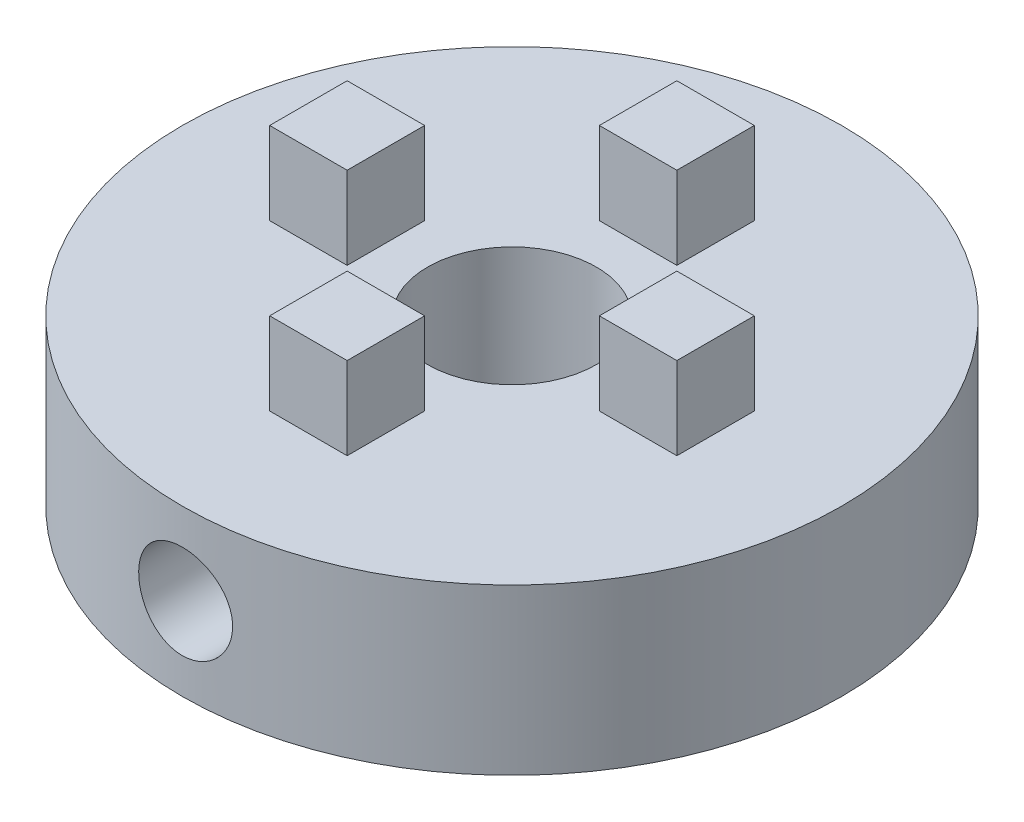
ISO-10303-21;
HEADER;
FILE_DESCRIPTION(('STEP AP214'),'2;1');
FILE_NAME('part.step','',(''),(''),'','','');
FILE_SCHEMA(('AUTOMOTIVE_DESIGN { 1 0 10303 214 1 1 1 1 }'));
ENDSEC;
DATA;
#1=APPLICATION_CONTEXT('core data for automotive mechanical design processes');
#2=APPLICATION_PROTOCOL_DEFINITION('international standard','automotive_design',2000,#1);
#3=PRODUCT_CONTEXT('',#1,'mechanical');
#4=PRODUCT('Part','Part','',(#3));
#5=PRODUCT_RELATED_PRODUCT_CATEGORY('part','',(#4));
#6=PRODUCT_DEFINITION_FORMATION('','',#4);
#7=PRODUCT_DEFINITION_CONTEXT('part definition',#1,'design');
#8=PRODUCT_DEFINITION('design','',#6,#7);
#9=PRODUCT_DEFINITION_SHAPE('','',#8);
#10=(LENGTH_UNIT() NAMED_UNIT(*) SI_UNIT(.MILLI.,.METRE.));
#11=(NAMED_UNIT(*) PLANE_ANGLE_UNIT() SI_UNIT($,.RADIAN.));
#12=(NAMED_UNIT(*) SI_UNIT($,.STERADIAN.) SOLID_ANGLE_UNIT());
#13=UNCERTAINTY_MEASURE_WITH_UNIT(LENGTH_MEASURE(1.E-05),#10,'distance_accuracy_value','');
#14=(GEOMETRIC_REPRESENTATION_CONTEXT(3) GLOBAL_UNCERTAINTY_ASSIGNED_CONTEXT((#13)) GLOBAL_UNIT_ASSIGNED_CONTEXT((#10,
#11,#12)) REPRESENTATION_CONTEXT('',''));
#15=CARTESIAN_POINT('',(0.,0.,0.));
#16=DIRECTION('',(0.,0.,1.));
#17=DIRECTION('',(1.,0.,0.));
#18=AXIS2_PLACEMENT_3D('',#15,#16,#17);
#19=CARTESIAN_POINT('',(0.,10.,0.));
#20=DIRECTION('',(0.,-1.,0.));
#21=DIRECTION('',(0.,0.,-1.));
#22=AXIS2_PLACEMENT_3D('',#19,#20,#21);
#23=CYLINDRICAL_SURFACE('',#22,20.);
#24=CARTESIAN_POINT('',(0.,0.,0.));
#25=DIRECTION('',(0.,1.,0.));
#26=DIRECTION('',(0.,0.,1.));
#27=AXIS2_PLACEMENT_3D('',#24,#25,#26);
#28=CIRCLE('',#27,20.);
#29=CARTESIAN_POINT('',(0.,0.,20.));
#30=VERTEX_POINT('',#29);
#31=EDGE_CURVE('E323',#30,#30,#28,.T.);
#32=ORIENTED_EDGE('',*,*,#31,.T.);
#33=EDGE_LOOP('',(#32));
#34=FACE_BOUND('',#33,.T.);
#35=CARTESIAN_POINT('',(0.,10.,0.));
#36=DIRECTION('',(0.,1.,0.));
#37=DIRECTION('',(0.,0.,1.));
#38=AXIS2_PLACEMENT_3D('',#35,#36,#37);
#39=CIRCLE('',#38,20.);
#40=CARTESIAN_POINT('',(0.,10.,20.));
#41=VERTEX_POINT('',#40);
#42=EDGE_CURVE('E58',#41,#41,#39,.T.);
#43=ORIENTED_EDGE('',*,*,#42,.F.);
#44=EDGE_LOOP('',(#43));
#45=FACE_BOUND('',#44,.T.);
#46=CARTESIAN_POINT('',(0.,2.15,20.));
#47=CARTESIAN_POINT('',(0.159220597601902,2.15000663401519,19.999997539858));
#48=CARTESIAN_POINT('',(0.318535855093513,2.16338776409981,19.9980786844987));
#49=CARTESIAN_POINT('',(0.632719610397276,2.21654879190933,19.9906086304443));
#50=CARTESIAN_POINT('',(0.787583517976093,2.25635498734231,19.9850538133884));
#51=CARTESIAN_POINT('',(1.08827172153135,2.36115793459101,19.9709365650736));
#52=CARTESIAN_POINT('',(1.23410252322149,2.42613630667082,19.9623763286804));
#53=CARTESIAN_POINT('',(1.51276638360188,2.57939563281154,19.9431961042645));
#54=CARTESIAN_POINT('',(1.64560137774481,2.66767310969667,19.9325764236574));
#55=CARTESIAN_POINT('',(1.89546728302553,2.86569127382669,19.9103756970087));
#56=CARTESIAN_POINT('',(2.01239287658,2.97556423386648,19.8987889931623));
#57=CARTESIAN_POINT('',(2.22621272310081,3.21336996106828,19.8760048164301));
#58=CARTESIAN_POINT('',(2.32310586757241,3.34130372696542,19.8648073651122));
#59=CARTESIAN_POINT('',(2.4945150070151,3.61230010913558,19.8440144444241));
#60=CARTESIAN_POINT('',(2.5689300865771,3.75542716512327,19.8344262830255));
#61=CARTESIAN_POINT('',(2.6926259707918,4.05230737296626,19.8180140944292));
#62=CARTESIAN_POINT('',(2.74190801105827,4.2060600020152,19.8111899313486));
#63=CARTESIAN_POINT('',(2.81361392025149,4.51872344376345,19.8011336049838));
#64=CARTESIAN_POINT('',(2.83621737885531,4.67759228348999,19.7978774341475));
#65=CARTESIAN_POINT('',(2.85448064673573,4.9968989120245,19.7952527280753));
#66=CARTESIAN_POINT('',(2.8501418545263,5.15733661896434,19.7958839910511));
#67=CARTESIAN_POINT('',(2.81479075318449,5.47396357498162,19.8009408655297));
#68=CARTESIAN_POINT('',(2.78397775770168,5.63017559502494,19.805338123578));
#69=CARTESIAN_POINT('',(2.69686459579977,5.93518924940246,19.8173872639575));
#70=CARTESIAN_POINT('',(2.64056377301033,6.08399069278768,19.8250392301047));
#71=CARTESIAN_POINT('',(2.50386363333996,6.37056975424894,19.8427671946178));
#72=CARTESIAN_POINT('',(2.42337919748618,6.50830622030809,19.852851729747));
#73=CARTESIAN_POINT('',(2.240657192388,6.76839403365232,19.8743022655916));
#74=CARTESIAN_POINT('',(2.13841833286552,6.89074446769032,19.8856683422978));
#75=CARTESIAN_POINT('',(1.91399224067261,7.11774284816231,19.9085268252002));
#76=CARTESIAN_POINT('',(1.79163350336117,7.22222128627938,19.920019446624));
#77=CARTESIAN_POINT('',(1.53102739782766,7.4091850374753,19.941740732093));
#78=CARTESIAN_POINT('',(1.39277997173841,7.49167027045049,19.9519693915344));
#79=CARTESIAN_POINT('',(1.10417906584821,7.63231212306172,19.970019481073));
#80=CARTESIAN_POINT('',(0.95381951506255,7.69045645063674,19.9778396943888));
#81=CARTESIAN_POINT('',(0.645334234160163,7.7806227195811,19.9901813636095));
#82=CARTESIAN_POINT('',(0.487208978067433,7.81264625328572,19.994703020594));
#83=CARTESIAN_POINT('',(0.169144702322913,7.84943832389168,19.999911639521));
#84=CARTESIAN_POINT('',(0.00923317347973181,7.85444004682281,20.000631408829));
#85=CARTESIAN_POINT('',(-0.309146157725147,7.83766432695207,19.998244227893));
#86=CARTESIAN_POINT('',(-0.467614000182101,7.81588763016082,19.9951373842532));
#87=CARTESIAN_POINT('',(-0.77790712938567,7.74636708980198,19.9854663808907));
#88=CARTESIAN_POINT('',(-0.929758205533332,7.69873608349741,19.978917248428));
#89=CARTESIAN_POINT('',(-1.22331863158352,7.57897744924714,19.9630939695892));
#90=CARTESIAN_POINT('',(-1.36502754568522,7.50684876941963,19.9538197062036));
#91=CARTESIAN_POINT('',(-1.63531156595823,7.3395897490991,19.9334961515912));
#92=CARTESIAN_POINT('',(-1.76379369136366,7.24431055620133,19.9224355354243));
#93=CARTESIAN_POINT('',(-2.00302705768156,7.03366343212809,19.8998077647578));
#94=CARTESIAN_POINT('',(-2.11377737291061,6.91829445282773,19.8882405838533));
#95=CARTESIAN_POINT('',(-2.31524511039574,6.66970794741774,19.8658002275954));
#96=CARTESIAN_POINT('',(-2.40580675907755,6.53636356909708,19.8549328798402));
#97=CARTESIAN_POINT('',(-2.5632458061488,6.25621885656584,19.8352235399862));
#98=CARTESIAN_POINT('',(-2.63012379420634,6.10941885748353,19.826381497464));
#99=CARTESIAN_POINT('',(-2.73805221349558,5.80700662668857,19.8117653593948));
#100=CARTESIAN_POINT('',(-2.77918647710155,5.65142481586857,19.8059813153745));
#101=CARTESIAN_POINT('',(-2.83472769283635,5.33547319963288,19.7981089752667));
#102=CARTESIAN_POINT('',(-2.84913629607712,5.17510369062332,19.7960204508702));
#103=CARTESIAN_POINT('',(-2.85078075598099,4.85568060201485,19.7957835702566));
#104=CARTESIAN_POINT('',(-2.8382614610153,4.69662825470876,19.7975997098805));
#105=CARTESIAN_POINT('',(-2.78692822264851,4.38291478116467,19.8048906293529));
#106=CARTESIAN_POINT('',(-2.74811430563739,4.22825365051968,19.8103654055295));
#107=CARTESIAN_POINT('',(-2.64537707190892,3.92776946050174,19.824344771114));
#108=CARTESIAN_POINT('',(-2.58146919373022,3.78194103054456,19.8328474973397));
#109=CARTESIAN_POINT('',(-2.43038232128556,3.50303698214488,19.8519272207514));
#110=CARTESIAN_POINT('',(-2.34320269509322,3.36996171013792,19.8625042742622));
#111=CARTESIAN_POINT('',(-2.14715120782728,3.11909486602407,19.8846556504724));
#112=CARTESIAN_POINT('',(-2.03809757493737,3.00144602758159,19.896237834646));
#113=CARTESIAN_POINT('',(-1.80177724882134,2.78602962970488,19.9190275961439));
#114=CARTESIAN_POINT('',(-1.674506311338,2.68826671616852,19.9302350854192));
#115=CARTESIAN_POINT('',(-1.40462820691276,2.51497069651331,19.9510754611919));
#116=CARTESIAN_POINT('',(-1.26194830543444,2.4395499222891,19.9607002861389));
#117=CARTESIAN_POINT('',(-0.965880706730123,2.3138532780493,19.9772112527449));
#118=CARTESIAN_POINT('',(-0.812504469061582,2.26355095496615,19.9841002739964));
#119=CARTESIAN_POINT('',(-0.548670962429879,2.20113287737581,19.9927625847196));
#120=CARTESIAN_POINT('',(-0.43985425347647,2.18198678715794,19.9954629075567));
#121=CARTESIAN_POINT('',(-0.220706848975509,2.15641811694065,19.9990824584098));
#122=CARTESIAN_POINT('',(-0.110376169602727,2.1499954011152,20.0000017054392));
#123=CARTESIAN_POINT('',(0.,2.15,20.));
#124=B_SPLINE_CURVE_WITH_KNOTS('',3,(#46,#47,#48,#49,#50,#51,#52,#53,#54,#55,#56,#57,#58,#59,
#60,#61,#62,#63,#64,#65,#66,#67,#68,#69,#70,#71,#72,#73,#74,#75,#76,#77,#78,#79,#80,#81,#82,#83,
#84,#85,#86,#87,#88,#89,#90,#91,#92,#93,#94,#95,#96,#97,#98,#99,#100,#101,#102,#103,#104,#105,
#106,#107,#108,#109,#110,#111,#112,#113,#114,#115,#116,#117,#118,#119,#120,#121,#122,#123),
.UNSPECIFIED.,.T.,.F.,(4,2,2,2,2,2,2,2,2,2,2,2,2,2,2,2,2,2,2,2,2,2,2,2,2,2,2,2,2,2,2,2,2,2,2,2,
2,2,4),(0.,0.477258517787081,0.954992707363484,1.43237872964785,1.90969354673257,
2.39002854327752,2.87039011202972,3.35287726613205,3.83534069746631,4.31453750881385,
4.79370944629932,5.26930518853187,5.74491317914883,6.22221517450057,6.69954548703763,
7.1811783795388,7.6628130262198,8.14469060394401,8.62653880399993,9.10422215011185,
9.5818921889122,10.0574940766366,10.5331163883509,11.0118817628239,11.4906721229448,
11.9730378967639,12.4553916599515,12.9361663902525,13.4169114172896,13.8933036454507,
14.3696953954926,14.84579451347,15.3219065608671,15.8021524769137,16.2825104630464,
16.765244127928,17.2474683322274,17.5783208114913,17.9091697587822),.UNSPECIFIED.);
#125=CARTESIAN_POINT('',(0.,2.15,20.));
#126=VERTEX_POINT('',#125);
#127=EDGE_CURVE('E11',#126,#126,#124,.T.);
#128=ORIENTED_EDGE('',*,*,#127,.F.);
#129=EDGE_LOOP('',(#128));
#130=FACE_BOUND('',#129,.T.);
#131=ADVANCED_FACE('F45',(#34,#45,#130),#23,.T.);
#132=CARTESIAN_POINT('',(0.,5.,20.));
#133=DIRECTION('',(0.,0.,-1.));
#134=DIRECTION('',(-1.,0.,0.));
#135=AXIS2_PLACEMENT_3D('',#132,#133,#134);
#136=CYLINDRICAL_SURFACE('',#135,2.);
#137=CARTESIAN_POINT('',(-2.,5.,4.71864652204422));
#138=CARTESIAN_POINT('',(-2.00000578762234,4.89235917877147,4.71864087723582));
#139=CARTESIAN_POINT('',(-1.99128148782472,4.78475451794615,4.72236954117164));
#140=CARTESIAN_POINT('',(-1.95679113974987,4.57281063835751,4.73676480426923));
#141=CARTESIAN_POINT('',(-1.93102662964805,4.46847112574801,4.74743077721674));
#142=CARTESIAN_POINT('',(-1.86356267643658,4.26618622442936,4.77431234516666));
#143=CARTESIAN_POINT('',(-1.82190429650557,4.16822511376671,4.79051362804143));
#144=CARTESIAN_POINT('',(-1.723982175286,3.98064303408599,4.82661635586645));
#145=CARTESIAN_POINT('',(-1.6677136881104,3.89102478800454,4.84651900255526));
#146=CARTESIAN_POINT('',(-1.53891944186683,3.71783937114475,4.88898373330666));
#147=CARTESIAN_POINT('',(-1.46573157722868,3.63478470529647,4.91162838308456));
#148=CARTESIAN_POINT('',(-1.30657772615958,3.48176230776863,4.95634005649461));
#149=CARTESIAN_POINT('',(-1.2206087226416,3.41179767492385,4.97840694229062));
#150=CARTESIAN_POINT('',(-1.03438620102886,3.28441444073593,5.02046844435902));
#151=CARTESIAN_POINT('',(-0.933719592166502,3.22756089064465,5.04035511729326));
#152=CARTESIAN_POINT('',(-0.723336164989091,3.13181193427674,5.07481498699164));
#153=CARTESIAN_POINT('',(-0.613622785963195,3.09290974023778,5.08939019168776));
#154=CARTESIAN_POINT('',(-0.393653762963542,3.0359892528189,5.11099811073058));
#155=CARTESIAN_POINT('',(-0.283658768116353,3.01708686285201,5.11834900056737));
#156=CARTESIAN_POINT('',(-0.0618286163846342,2.99786125864979,5.12582683151972));
#157=CARTESIAN_POINT('',(0.0500058784267901,2.99753150003937,5.12595631721679));
#158=CARTESIAN_POINT('',(0.265971533418053,3.01496392788337,5.11917382197887));
#159=CARTESIAN_POINT('',(0.370194687588056,3.03175898612674,5.11263824843616));
#160=CARTESIAN_POINT('',(0.574207456311505,3.08132648032702,5.0937619295127));
#161=CARTESIAN_POINT('',(0.673996754023021,3.11410005610638,5.08142076999454));
#162=CARTESIAN_POINT('',(0.868082054613633,3.19510118234817,5.05191507424721));
#163=CARTESIAN_POINT('',(0.962274037944409,3.24355174701785,5.03468140154983));
#164=CARTESIAN_POINT('',(1.14143074145284,3.35432741342946,4.99711436043437));
#165=CARTESIAN_POINT('',(1.22639234734738,3.41665717644591,4.97677995137098));
#166=CARTESIAN_POINT('',(1.39034252007051,3.55799294126375,4.93357956488281));
#167=CARTESIAN_POINT('',(1.46862010699314,3.63780081623542,4.91063480174291));
#168=CARTESIAN_POINT('',(1.61096264895017,3.80952018874052,4.86579962287826));
#169=CARTESIAN_POINT('',(1.67502340046064,3.9014352532672,4.84390952048125));
#170=CARTESIAN_POINT('',(1.78863157922206,4.09778936880921,4.80314169597723));
#171=CARTESIAN_POINT('',(1.83776258163189,4.2024900678166,4.78435611073002));
#172=CARTESIAN_POINT('',(1.91741824722228,4.4196068278868,4.75299765823803));
#173=CARTESIAN_POINT('',(1.94795430300392,4.53201811781526,4.74042098786159));
#174=CARTESIAN_POINT('',(1.98786836712597,4.75429669512242,4.72381702549812));
#175=CARTESIAN_POINT('',(1.99838503769074,4.86392482606045,4.71933045453776));
#176=CARTESIAN_POINT('',(2.00126873525087,5.0834472246546,4.71810933037854));
#177=CARTESIAN_POINT('',(1.99364086374875,5.19334140882871,4.72137259824182));
#178=CARTESIAN_POINT('',(1.96148714895069,5.40414911942988,4.73481401077541));
#179=CARTESIAN_POINT('',(1.93788007993358,5.50522966241944,4.7446157807605));
#180=CARTESIAN_POINT('',(1.87561567091939,5.70193650701864,4.76957100358317));
#181=CARTESIAN_POINT('',(1.8369550939774,5.79756163047955,4.78472560737159));
#182=CARTESIAN_POINT('',(1.74397492050858,5.98484033705981,4.8194111626842));
#183=CARTESIAN_POINT('',(1.68909834059015,6.07618896662555,4.839091025273));
#184=CARTESIAN_POINT('',(1.56582234077128,6.24878229438386,4.88037353578147));
#185=CARTESIAN_POINT('',(1.49741762832862,6.33002301778209,4.90197693441197));
#186=CARTESIAN_POINT('',(1.34339651990036,6.48597213499423,4.94649007624255));
#187=CARTESIAN_POINT('',(1.25691310007093,6.55983128134504,4.9693859901504));
#188=CARTESIAN_POINT('',(1.07222586330931,6.69210839971146,5.01247814881231));
#189=CARTESIAN_POINT('',(0.97402175542571,6.75052598829394,5.03267432652242));
#190=CARTESIAN_POINT('',(0.768508636816092,6.84997229524272,5.06812207301574));
#191=CARTESIAN_POINT('',(0.661214719125564,6.8910291860635,5.08338164325837));
#192=CARTESIAN_POINT('',(0.440505121296026,6.95425538202722,5.10723724983198));
#193=CARTESIAN_POINT('',(0.327092620392373,6.97643439755347,5.11583671177773));
#194=CARTESIAN_POINT('',(0.105009802417273,7.00016448237447,5.12505375209233));
#195=CARTESIAN_POINT('',(-0.00351371138491119,7.00291848731404,5.12613673255765));
#196=CARTESIAN_POINT('',(-0.219417993659444,6.99086436306953,5.12143866148043));
#197=CARTESIAN_POINT('',(-0.326798917874057,6.97605865914555,5.11565855783298));
#198=CARTESIAN_POINT('',(-0.534282974427644,6.93016031939586,5.09810891092108));
#199=CARTESIAN_POINT('',(-0.634505871698667,6.89953770085411,5.08651247976537));
#200=CARTESIAN_POINT('',(-0.828383977648806,6.82335811974725,5.05855791393854));
#201=CARTESIAN_POINT('',(-0.922037940451345,6.77779833341826,5.04219887899707));
#202=CARTESIAN_POINT('',(-1.10458627081271,6.67079771042108,5.00545310767268));
#203=CARTESIAN_POINT('',(-1.19309695839034,6.60875279353292,4.98492223858703));
#204=CARTESIAN_POINT('',(-1.35881099284943,6.47146892170575,4.94232641440077));
#205=CARTESIAN_POINT('',(-1.43601016885699,6.39622512232277,4.92026089783258));
#206=CARTESIAN_POINT('',(-1.58155388493147,6.22948347411915,4.87549463327506));
#207=CARTESIAN_POINT('',(-1.64912137572491,6.13729441713602,4.85283167956852));
#208=CARTESIAN_POINT('',(-1.76787262127908,5.94216513432708,4.81084526291957));
#209=CARTESIAN_POINT('',(-1.81905193922794,5.8392220070117,4.79152270498142));
#210=CARTESIAN_POINT('',(-1.90660158308154,5.61665809272019,4.75740514185469));
#211=CARTESIAN_POINT('',(-1.94146672212637,5.49636200245357,4.7430936598225));
#212=CARTESIAN_POINT('',(-1.98815301182806,5.25069140500734,4.72372146940304));
#213=CARTESIAN_POINT('',(-1.99999326174085,5.12532119504274,4.71865309403174));
#214=CARTESIAN_POINT('',(-2.,5.,4.71864652204422));
#215=B_SPLINE_CURVE_WITH_KNOTS('',3,(#137,#138,#139,#140,#141,#142,#143,#144,#145,#146,#147,
#148,#149,#150,#151,#152,#153,#154,#155,#156,#157,#158,#159,#160,#161,#162,#163,#164,#165,#166,
#167,#168,#169,#170,#171,#172,#173,#174,#175,#176,#177,#178,#179,#180,#181,#182,#183,#184,#185,
#186,#187,#188,#189,#190,#191,#192,#193,#194,#195,#196,#197,#198,#199,#200,#201,#202,#203,#204,
#205,#206,#207,#208,#209,#210,#211,#212,#213,#214),.UNSPECIFIED.,.T.,.F.,(4,2,2,2,2,2,2,2,2,2,2,
2,2,2,2,2,2,2,2,2,2,2,2,2,2,2,2,2,2,2,2,2,2,2,2,2,2,2,4),(0.,0.322454842835148,
0.644880582483201,0.966478887423679,1.28818179001113,1.62566610392035,1.96323021048649,
2.31338057811043,2.66339843825409,2.99719900228042,3.33088194539838,3.64671002362366,
3.96256063464137,4.28311798801008,4.60378316212422,4.94460148097175,5.28552043648415,
5.63522246574122,5.98471002626553,6.31364482123499,6.64248714413618,6.95386823024453,
7.26531630941118,7.589036261571,7.91288311246866,8.25928883577716,8.60570315996352,
8.95155315498894,9.29722514433275,9.62128632722279,9.94530275759767,10.2602017634187,
10.5751603329841,10.9038054644112,11.2325714732676,11.5804756684785,11.9284739732016,
12.3042049329557,12.679624088906),.UNSPECIFIED.);
#216=CARTESIAN_POINT('',(-2.,5.,4.71864652204422));
#217=VERTEX_POINT('',#216);
#218=EDGE_CURVE('E333',#217,#217,#215,.T.);
#219=ORIENTED_EDGE('',*,*,#218,.F.);
#220=EDGE_LOOP('',(#219));
#221=FACE_BOUND('',#220,.T.);
#222=CARTESIAN_POINT('',(0.,5.,10.));
#223=DIRECTION('',(0.,0.,1.));
#224=DIRECTION('',(1.,0.,0.));
#225=AXIS2_PLACEMENT_3D('',#222,#223,#224);
#226=CIRCLE('',#225,2.);
#227=CARTESIAN_POINT('',(2.,5.,10.));
#228=VERTEX_POINT('',#227);
#229=EDGE_CURVE('E341',#228,#228,#226,.T.);
#230=ORIENTED_EDGE('',*,*,#229,.T.);
#231=EDGE_LOOP('',(#230));
#232=FACE_BOUND('',#231,.T.);
#233=ADVANCED_FACE('F346',(#221,#232),#136,.F.);
#234=CARTESIAN_POINT('',(0.,10.,0.));
#235=DIRECTION('',(0.,-1.,0.));
#236=DIRECTION('',(0.,0.,-1.));
#237=AXIS2_PLACEMENT_3D('',#234,#235,#236);
#238=CYLINDRICAL_SURFACE('',#237,5.125);
#239=CARTESIAN_POINT('',(0.,0.,0.));
#240=DIRECTION('',(0.,1.,0.));
#241=DIRECTION('',(0.,0.,1.));
#242=AXIS2_PLACEMENT_3D('',#239,#240,#241);
#243=CIRCLE('',#242,5.125);
#244=CARTESIAN_POINT('',(0.,0.,5.125));
#245=VERTEX_POINT('',#244);
#246=EDGE_CURVE('E318',#245,#245,#243,.T.);
#247=ORIENTED_EDGE('',*,*,#246,.F.);
#248=EDGE_LOOP('',(#247));
#249=FACE_BOUND('',#248,.T.);
#250=CARTESIAN_POINT('',(0.,10.,0.));
#251=DIRECTION('',(0.,1.,0.));
#252=DIRECTION('',(0.,0.,1.));
#253=AXIS2_PLACEMENT_3D('',#250,#251,#252);
#254=CIRCLE('',#253,5.125);
#255=CARTESIAN_POINT('',(0.,10.,5.125));
#256=VERTEX_POINT('',#255);
#257=EDGE_CURVE('E319',#256,#256,#254,.T.);
#258=ORIENTED_EDGE('',*,*,#257,.T.);
#259=EDGE_LOOP('',(#258));
#260=FACE_BOUND('',#259,.T.);
#261=ORIENTED_EDGE('',*,*,#218,.T.);
#262=EDGE_LOOP('',(#261));
#263=FACE_BOUND('',#262,.T.);
#264=ADVANCED_FACE('F342',(#249,#260,#263),#238,.F.);
#265=CARTESIAN_POINT('',(0.,10.,0.));
#266=DIRECTION('',(0.,1.,0.));
#267=DIRECTION('',(0.,0.,1.));
#268=AXIS2_PLACEMENT_3D('',#265,#266,#267);
#269=PLANE('',#268);
#270=ORIENTED_EDGE('',*,*,#42,.T.);
#271=EDGE_LOOP('',(#270));
#272=FACE_BOUND('',#271,.T.);
#273=ORIENTED_EDGE('',*,*,#257,.F.);
#274=EDGE_LOOP('',(#273));
#275=FACE_BOUND('',#274,.T.);
#276=DIRECTION('',(-1.,0.,0.));
#277=VECTOR('',#276,1.);
#278=CARTESIAN_POINT('',(-2.35,10.,-12.35));
#279=LINE('',#278,#277);
#280=CARTESIAN_POINT('',(2.35,10.,-12.35));
#281=VERTEX_POINT('',#280);
#282=CARTESIAN_POINT('',(-2.35,10.,-12.35));
#283=VERTEX_POINT('',#282);
#284=EDGE_CURVE('E296',#281,#283,#279,.T.);
#285=ORIENTED_EDGE('',*,*,#284,.F.);
#286=DIRECTION('',(0.,0.,-1.));
#287=VECTOR('',#286,1.);
#288=CARTESIAN_POINT('',(2.35,10.,-7.65));
#289=LINE('',#288,#287);
#290=CARTESIAN_POINT('',(2.35,10.,-7.65));
#291=VERTEX_POINT('',#290);
#292=EDGE_CURVE('E277',#291,#281,#289,.T.);
#293=ORIENTED_EDGE('',*,*,#292,.F.);
#294=DIRECTION('',(1.,0.,0.));
#295=VECTOR('',#294,1.);
#296=CARTESIAN_POINT('',(-2.35,10.,-7.65));
#297=LINE('',#296,#295);
#298=CARTESIAN_POINT('',(-2.35,10.,-7.65));
#299=VERTEX_POINT('',#298);
#300=EDGE_CURVE('E283',#299,#291,#297,.T.);
#301=ORIENTED_EDGE('',*,*,#300,.F.);
#302=DIRECTION('',(0.,0.,1.));
#303=VECTOR('',#302,1.);
#304=CARTESIAN_POINT('',(-2.35,10.,-7.65));
#305=LINE('',#304,#303);
#306=EDGE_CURVE('E299',#283,#299,#305,.T.);
#307=ORIENTED_EDGE('',*,*,#306,.F.);
#308=EDGE_LOOP('',(#285,#293,#301,#307));
#309=FACE_BOUND('',#308,.T.);
#310=DIRECTION('',(-1.,0.,0.));
#311=VECTOR('',#310,1.);
#312=CARTESIAN_POINT('',(7.65,10.,-2.35));
#313=LINE('',#312,#311);
#314=CARTESIAN_POINT('',(12.35,10.,-2.35));
#315=VERTEX_POINT('',#314);
#316=CARTESIAN_POINT('',(7.65,10.,-2.35));
#317=VERTEX_POINT('',#316);
#318=EDGE_CURVE('E255',#315,#317,#313,.T.);
#319=ORIENTED_EDGE('',*,*,#318,.F.);
#320=DIRECTION('',(0.,0.,-1.));
#321=VECTOR('',#320,1.);
#322=CARTESIAN_POINT('',(12.35,10.,-2.35));
#323=LINE('',#322,#321);
#324=CARTESIAN_POINT('',(12.35,10.,2.35));
#325=VERTEX_POINT('',#324);
#326=EDGE_CURVE('E236',#325,#315,#323,.T.);
#327=ORIENTED_EDGE('',*,*,#326,.F.);
#328=DIRECTION('',(1.,0.,0.));
#329=VECTOR('',#328,1.);
#330=CARTESIAN_POINT('',(7.65,10.,2.35));
#331=LINE('',#330,#329);
#332=CARTESIAN_POINT('',(7.65,10.,2.35));
#333=VERTEX_POINT('',#332);
#334=EDGE_CURVE('E242',#333,#325,#331,.T.);
#335=ORIENTED_EDGE('',*,*,#334,.F.);
#336=DIRECTION('',(0.,0.,1.));
#337=VECTOR('',#336,1.);
#338=CARTESIAN_POINT('',(7.65,10.,-2.35));
#339=LINE('',#338,#337);
#340=EDGE_CURVE('E258',#317,#333,#339,.T.);
#341=ORIENTED_EDGE('',*,*,#340,.F.);
#342=EDGE_LOOP('',(#319,#327,#335,#341));
#343=FACE_BOUND('',#342,.T.);
#344=DIRECTION('',(0.,0.,-1.));
#345=VECTOR('',#344,1.);
#346=CARTESIAN_POINT('',(2.35,10.,7.65));
#347=LINE('',#346,#345);
#348=CARTESIAN_POINT('',(2.35,10.,12.35));
#349=VERTEX_POINT('',#348);
#350=CARTESIAN_POINT('',(2.35,10.,7.65));
#351=VERTEX_POINT('',#350);
#352=EDGE_CURVE('E197',#349,#351,#347,.T.);
#353=ORIENTED_EDGE('',*,*,#352,.F.);
#354=DIRECTION('',(1.,0.,0.));
#355=VECTOR('',#354,1.);
#356=CARTESIAN_POINT('',(2.35,10.,12.35));
#357=LINE('',#356,#355);
#358=CARTESIAN_POINT('',(-2.35,10.,12.35));
#359=VERTEX_POINT('',#358);
#360=EDGE_CURVE('E192',#359,#349,#357,.T.);
#361=ORIENTED_EDGE('',*,*,#360,.F.);
#362=DIRECTION('',(0.,0.,1.));
#363=VECTOR('',#362,1.);
#364=CARTESIAN_POINT('',(-2.35,10.,7.65));
#365=LINE('',#364,#363);
#366=CARTESIAN_POINT('',(-2.35,10.,7.65));
#367=VERTEX_POINT('',#366);
#368=EDGE_CURVE('E207',#367,#359,#365,.T.);
#369=ORIENTED_EDGE('',*,*,#368,.F.);
#370=DIRECTION('',(-1.,0.,0.));
#371=VECTOR('',#370,1.);
#372=CARTESIAN_POINT('',(2.35,10.,7.65));
#373=LINE('',#372,#371);
#374=EDGE_CURVE('E219',#351,#367,#373,.T.);
#375=ORIENTED_EDGE('',*,*,#374,.F.);
#376=EDGE_LOOP('',(#353,#361,#369,#375));
#377=FACE_BOUND('',#376,.T.);
#378=DIRECTION('',(1.,0.,0.));
#379=VECTOR('',#378,1.);
#380=CARTESIAN_POINT('',(-7.65,10.,2.35));
#381=LINE('',#380,#379);
#382=CARTESIAN_POINT('',(-12.35,10.,2.35));
#383=VERTEX_POINT('',#382);
#384=CARTESIAN_POINT('',(-7.65,10.,2.35));
#385=VERTEX_POINT('',#384);
#386=EDGE_CURVE('E463',#383,#385,#381,.T.);
#387=ORIENTED_EDGE('',*,*,#386,.F.);
#388=DIRECTION('',(0.,0.,1.));
#389=VECTOR('',#388,1.);
#390=CARTESIAN_POINT('',(-12.35,10.,2.35));
#391=LINE('',#390,#389);
#392=CARTESIAN_POINT('',(-12.35,10.,-2.35));
#393=VERTEX_POINT('',#392);
#394=EDGE_CURVE('E189',#393,#383,#391,.T.);
#395=ORIENTED_EDGE('',*,*,#394,.F.);
#396=DIRECTION('',(-1.,0.,0.));
#397=VECTOR('',#396,1.);
#398=CARTESIAN_POINT('',(-7.65,10.,-2.35));
#399=LINE('',#398,#397);
#400=CARTESIAN_POINT('',(-7.65,10.,-2.35));
#401=VERTEX_POINT('',#400);
#402=EDGE_CURVE('E185',#401,#393,#399,.T.);
#403=ORIENTED_EDGE('',*,*,#402,.F.);
#404=DIRECTION('',(0.,0.,-1.));
#405=VECTOR('',#404,1.);
#406=CARTESIAN_POINT('',(-7.65,10.,2.35));
#407=LINE('',#406,#405);
#408=EDGE_CURVE('E466',#385,#401,#407,.T.);
#409=ORIENTED_EDGE('',*,*,#408,.F.);
#410=EDGE_LOOP('',(#387,#395,#403,#409));
#411=FACE_BOUND('',#410,.T.);
#412=ADVANCED_FACE('F428',(#272,#275,#309,#343,#377,#411),#269,.T.);
#413=CARTESIAN_POINT('',(0.,0.,0.));
#414=DIRECTION('',(0.,1.,0.));
#415=DIRECTION('',(0.,0.,1.));
#416=AXIS2_PLACEMENT_3D('',#413,#414,#415);
#417=PLANE('',#416);
#418=ORIENTED_EDGE('',*,*,#31,.F.);
#419=EDGE_LOOP('',(#418));
#420=FACE_BOUND('',#419,.T.);
#421=ORIENTED_EDGE('',*,*,#246,.T.);
#422=EDGE_LOOP('',(#421));
#423=FACE_BOUND('',#422,.T.);
#424=ADVANCED_FACE('F423',(#420,#423),#417,.F.);
#425=CARTESIAN_POINT('',(2.35,15.,-7.65));
#426=DIRECTION('',(-1.,0.,0.));
#427=DIRECTION('',(0.,0.,1.));
#428=AXIS2_PLACEMENT_3D('',#425,#426,#427);
#429=PLANE('',#428);
#430=ORIENTED_EDGE('',*,*,#292,.T.);
#431=DIRECTION('',(0.,-1.,0.));
#432=VECTOR('',#431,1.);
#433=CARTESIAN_POINT('',(2.35,15.,-12.35));
#434=LINE('',#433,#432);
#435=CARTESIAN_POINT('',(2.35,15.,-12.35));
#436=VERTEX_POINT('',#435);
#437=EDGE_CURVE('E315',#436,#281,#434,.T.);
#438=ORIENTED_EDGE('',*,*,#437,.F.);
#439=DIRECTION('',(0.,0.,-1.));
#440=VECTOR('',#439,1.);
#441=CARTESIAN_POINT('',(2.35,15.,-7.65));
#442=LINE('',#441,#440);
#443=CARTESIAN_POINT('',(2.35,15.,-7.65));
#444=VERTEX_POINT('',#443);
#445=EDGE_CURVE('E278',#444,#436,#442,.T.);
#446=ORIENTED_EDGE('',*,*,#445,.F.);
#447=DIRECTION('',(0.,-1.,0.));
#448=VECTOR('',#447,1.);
#449=CARTESIAN_POINT('',(2.35,15.,-7.65));
#450=LINE('',#449,#448);
#451=EDGE_CURVE('E292',#444,#291,#450,.T.);
#452=ORIENTED_EDGE('',*,*,#451,.T.);
#453=EDGE_LOOP('',(#430,#438,#446,#452));
#454=FACE_BOUND('',#453,.T.);
#455=ADVANCED_FACE('F420',(#454),#429,.F.);
#456=CARTESIAN_POINT('',(-2.35,15.,-12.35));
#457=DIRECTION('',(0.,0.,1.));
#458=DIRECTION('',(1.,0.,0.));
#459=AXIS2_PLACEMENT_3D('',#456,#457,#458);
#460=PLANE('',#459);
#461=ORIENTED_EDGE('',*,*,#284,.T.);
#462=DIRECTION('',(0.,-1.,0.));
#463=VECTOR('',#462,1.);
#464=CARTESIAN_POINT('',(-2.35,15.,-12.35));
#465=LINE('',#464,#463);
#466=CARTESIAN_POINT('',(-2.35,15.,-12.35));
#467=VERTEX_POINT('',#466);
#468=EDGE_CURVE('E311',#467,#283,#465,.T.);
#469=ORIENTED_EDGE('',*,*,#468,.F.);
#470=DIRECTION('',(-1.,0.,0.));
#471=VECTOR('',#470,1.);
#472=CARTESIAN_POINT('',(-2.35,15.,-12.35));
#473=LINE('',#472,#471);
#474=EDGE_CURVE('E282',#436,#467,#473,.T.);
#475=ORIENTED_EDGE('',*,*,#474,.F.);
#476=ORIENTED_EDGE('',*,*,#437,.T.);
#477=EDGE_LOOP('',(#461,#469,#475,#476));
#478=FACE_BOUND('',#477,.T.);
#479=ADVANCED_FACE('F417',(#478),#460,.F.);
#480=CARTESIAN_POINT('',(-2.35,15.,-7.65));
#481=DIRECTION('',(1.,0.,0.));
#482=DIRECTION('',(0.,0.,-1.));
#483=AXIS2_PLACEMENT_3D('',#480,#481,#482);
#484=PLANE('',#483);
#485=ORIENTED_EDGE('',*,*,#306,.T.);
#486=DIRECTION('',(0.,-1.,0.));
#487=VECTOR('',#486,1.);
#488=CARTESIAN_POINT('',(-2.35,15.,-7.65));
#489=LINE('',#488,#487);
#490=CARTESIAN_POINT('',(-2.35,15.,-7.65));
#491=VERTEX_POINT('',#490);
#492=EDGE_CURVE('E308',#491,#299,#489,.T.);
#493=ORIENTED_EDGE('',*,*,#492,.F.);
#494=DIRECTION('',(0.,0.,1.));
#495=VECTOR('',#494,1.);
#496=CARTESIAN_POINT('',(-2.35,15.,-7.65));
#497=LINE('',#496,#495);
#498=EDGE_CURVE('E286',#467,#491,#497,.T.);
#499=ORIENTED_EDGE('',*,*,#498,.F.);
#500=ORIENTED_EDGE('',*,*,#468,.T.);
#501=EDGE_LOOP('',(#485,#493,#499,#500));
#502=FACE_BOUND('',#501,.T.);
#503=ADVANCED_FACE('F413',(#502),#484,.F.);
#504=CARTESIAN_POINT('',(-2.35,15.,-7.65));
#505=DIRECTION('',(0.,0.,-1.));
#506=DIRECTION('',(-1.,0.,0.));
#507=AXIS2_PLACEMENT_3D('',#504,#505,#506);
#508=PLANE('',#507);
#509=ORIENTED_EDGE('',*,*,#300,.T.);
#510=ORIENTED_EDGE('',*,*,#451,.F.);
#511=DIRECTION('',(1.,0.,0.));
#512=VECTOR('',#511,1.);
#513=CARTESIAN_POINT('',(-2.35,15.,-7.65));
#514=LINE('',#513,#512);
#515=EDGE_CURVE('E289',#491,#444,#514,.T.);
#516=ORIENTED_EDGE('',*,*,#515,.F.);
#517=ORIENTED_EDGE('',*,*,#492,.T.);
#518=EDGE_LOOP('',(#509,#510,#516,#517));
#519=FACE_BOUND('',#518,.T.);
#520=ADVANCED_FACE('F409',(#519),#508,.F.);
#521=CARTESIAN_POINT('',(0.,15.,0.));
#522=DIRECTION('',(0.,-1.,0.));
#523=DIRECTION('',(0.,0.,-1.));
#524=AXIS2_PLACEMENT_3D('',#521,#522,#523);
#525=PLANE('',#524);
#526=ORIENTED_EDGE('',*,*,#445,.T.);
#527=ORIENTED_EDGE('',*,*,#474,.T.);
#528=ORIENTED_EDGE('',*,*,#498,.T.);
#529=ORIENTED_EDGE('',*,*,#515,.T.);
#530=EDGE_LOOP('',(#526,#527,#528,#529));
#531=FACE_BOUND('',#530,.T.);
#532=ADVANCED_FACE('F405',(#531),#525,.F.);
#533=CARTESIAN_POINT('',(12.35,15.,-2.35));
#534=DIRECTION('',(-1.,0.,0.));
#535=DIRECTION('',(0.,0.,1.));
#536=AXIS2_PLACEMENT_3D('',#533,#534,#535);
#537=PLANE('',#536);
#538=ORIENTED_EDGE('',*,*,#326,.T.);
#539=DIRECTION('',(0.,-1.,0.));
#540=VECTOR('',#539,1.);
#541=CARTESIAN_POINT('',(12.35,15.,-2.35));
#542=LINE('',#541,#540);
#543=CARTESIAN_POINT('',(12.35,15.,-2.35));
#544=VERTEX_POINT('',#543);
#545=EDGE_CURVE('E274',#544,#315,#542,.T.);
#546=ORIENTED_EDGE('',*,*,#545,.F.);
#547=DIRECTION('',(0.,0.,-1.));
#548=VECTOR('',#547,1.);
#549=CARTESIAN_POINT('',(12.35,15.,-2.35));
#550=LINE('',#549,#548);
#551=CARTESIAN_POINT('',(12.35,15.,2.35));
#552=VERTEX_POINT('',#551);
#553=EDGE_CURVE('E237',#552,#544,#550,.T.);
#554=ORIENTED_EDGE('',*,*,#553,.F.);
#555=DIRECTION('',(0.,-1.,0.));
#556=VECTOR('',#555,1.);
#557=CARTESIAN_POINT('',(12.35,15.,2.35));
#558=LINE('',#557,#556);
#559=EDGE_CURVE('E251',#552,#325,#558,.T.);
#560=ORIENTED_EDGE('',*,*,#559,.T.);
#561=EDGE_LOOP('',(#538,#546,#554,#560));
#562=FACE_BOUND('',#561,.T.);
#563=ADVANCED_FACE('F401',(#562),#537,.F.);
#564=CARTESIAN_POINT('',(7.65,15.,-2.35));
#565=DIRECTION('',(0.,0.,1.));
#566=DIRECTION('',(1.,0.,0.));
#567=AXIS2_PLACEMENT_3D('',#564,#565,#566);
#568=PLANE('',#567);
#569=ORIENTED_EDGE('',*,*,#318,.T.);
#570=DIRECTION('',(0.,-1.,0.));
#571=VECTOR('',#570,1.);
#572=CARTESIAN_POINT('',(7.65,15.,-2.35));
#573=LINE('',#572,#571);
#574=CARTESIAN_POINT('',(7.65,15.,-2.35));
#575=VERTEX_POINT('',#574);
#576=EDGE_CURVE('E270',#575,#317,#573,.T.);
#577=ORIENTED_EDGE('',*,*,#576,.F.);
#578=DIRECTION('',(-1.,0.,0.));
#579=VECTOR('',#578,1.);
#580=CARTESIAN_POINT('',(7.65,15.,-2.35));
#581=LINE('',#580,#579);
#582=EDGE_CURVE('E241',#544,#575,#581,.T.);
#583=ORIENTED_EDGE('',*,*,#582,.F.);
#584=ORIENTED_EDGE('',*,*,#545,.T.);
#585=EDGE_LOOP('',(#569,#577,#583,#584));
#586=FACE_BOUND('',#585,.T.);
#587=ADVANCED_FACE('F397',(#586),#568,.F.);
#588=CARTESIAN_POINT('',(7.65,15.,-2.35));
#589=DIRECTION('',(1.,0.,0.));
#590=DIRECTION('',(0.,0.,-1.));
#591=AXIS2_PLACEMENT_3D('',#588,#589,#590);
#592=PLANE('',#591);
#593=ORIENTED_EDGE('',*,*,#340,.T.);
#594=DIRECTION('',(0.,-1.,0.));
#595=VECTOR('',#594,1.);
#596=CARTESIAN_POINT('',(7.65,15.,2.35));
#597=LINE('',#596,#595);
#598=CARTESIAN_POINT('',(7.65,15.,2.35));
#599=VERTEX_POINT('',#598);
#600=EDGE_CURVE('E267',#599,#333,#597,.T.);
#601=ORIENTED_EDGE('',*,*,#600,.F.);
#602=DIRECTION('',(0.,0.,1.));
#603=VECTOR('',#602,1.);
#604=CARTESIAN_POINT('',(7.65,15.,-2.35));
#605=LINE('',#604,#603);
#606=EDGE_CURVE('E245',#575,#599,#605,.T.);
#607=ORIENTED_EDGE('',*,*,#606,.F.);
#608=ORIENTED_EDGE('',*,*,#576,.T.);
#609=EDGE_LOOP('',(#593,#601,#607,#608));
#610=FACE_BOUND('',#609,.T.);
#611=ADVANCED_FACE('F393',(#610),#592,.F.);
#612=CARTESIAN_POINT('',(7.65,15.,2.35));
#613=DIRECTION('',(0.,0.,-1.));
#614=DIRECTION('',(-1.,0.,0.));
#615=AXIS2_PLACEMENT_3D('',#612,#613,#614);
#616=PLANE('',#615);
#617=ORIENTED_EDGE('',*,*,#334,.T.);
#618=ORIENTED_EDGE('',*,*,#559,.F.);
#619=DIRECTION('',(1.,0.,0.));
#620=VECTOR('',#619,1.);
#621=CARTESIAN_POINT('',(7.65,15.,2.35));
#622=LINE('',#621,#620);
#623=EDGE_CURVE('E248',#599,#552,#622,.T.);
#624=ORIENTED_EDGE('',*,*,#623,.F.);
#625=ORIENTED_EDGE('',*,*,#600,.T.);
#626=EDGE_LOOP('',(#617,#618,#624,#625));
#627=FACE_BOUND('',#626,.T.);
#628=ADVANCED_FACE('F389',(#627),#616,.F.);
#629=CARTESIAN_POINT('',(0.,15.,0.));
#630=DIRECTION('',(0.,1.,0.));
#631=DIRECTION('',(0.,0.,1.));
#632=AXIS2_PLACEMENT_3D('',#629,#630,#631);
#633=PLANE('',#632);
#634=ORIENTED_EDGE('',*,*,#553,.T.);
#635=ORIENTED_EDGE('',*,*,#582,.T.);
#636=ORIENTED_EDGE('',*,*,#606,.T.);
#637=ORIENTED_EDGE('',*,*,#623,.T.);
#638=EDGE_LOOP('',(#634,#635,#636,#637));
#639=FACE_BOUND('',#638,.T.);
#640=ADVANCED_FACE('F385',(#639),#633,.T.);
#641=CARTESIAN_POINT('',(2.35,15.,12.35));
#642=DIRECTION('',(0.,0.,-1.));
#643=DIRECTION('',(-1.,0.,0.));
#644=AXIS2_PLACEMENT_3D('',#641,#642,#643);
#645=PLANE('',#644);
#646=ORIENTED_EDGE('',*,*,#360,.T.);
#647=DIRECTION('',(0.,-1.,0.));
#648=VECTOR('',#647,1.);
#649=CARTESIAN_POINT('',(2.35,15.,12.35));
#650=LINE('',#649,#648);
#651=CARTESIAN_POINT('',(2.35,15.,12.35));
#652=VERTEX_POINT('',#651);
#653=EDGE_CURVE('E233',#652,#349,#650,.T.);
#654=ORIENTED_EDGE('',*,*,#653,.F.);
#655=DIRECTION('',(1.,0.,0.));
#656=VECTOR('',#655,1.);
#657=CARTESIAN_POINT('',(2.35,15.,12.35));
#658=LINE('',#657,#656);
#659=CARTESIAN_POINT('',(-2.35,15.,12.35));
#660=VERTEX_POINT('',#659);
#661=EDGE_CURVE('E202',#660,#652,#658,.T.);
#662=ORIENTED_EDGE('',*,*,#661,.F.);
#663=DIRECTION('',(0.,-1.,0.));
#664=VECTOR('',#663,1.);
#665=CARTESIAN_POINT('',(-2.35,15.,12.35));
#666=LINE('',#665,#664);
#667=EDGE_CURVE('E215',#660,#359,#666,.T.);
#668=ORIENTED_EDGE('',*,*,#667,.T.);
#669=EDGE_LOOP('',(#646,#654,#662,#668));
#670=FACE_BOUND('',#669,.T.);
#671=ADVANCED_FACE('F381',(#670),#645,.F.);
#672=CARTESIAN_POINT('',(2.35,15.,7.65));
#673=DIRECTION('',(-1.,0.,0.));
#674=DIRECTION('',(0.,0.,1.));
#675=AXIS2_PLACEMENT_3D('',#672,#673,#674);
#676=PLANE('',#675);
#677=ORIENTED_EDGE('',*,*,#352,.T.);
#678=DIRECTION('',(0.,-1.,0.));
#679=VECTOR('',#678,1.);
#680=CARTESIAN_POINT('',(2.35,15.,7.65));
#681=LINE('',#680,#679);
#682=CARTESIAN_POINT('',(2.35,15.,7.65));
#683=VERTEX_POINT('',#682);
#684=EDGE_CURVE('E229',#683,#351,#681,.T.);
#685=ORIENTED_EDGE('',*,*,#684,.F.);
#686=DIRECTION('',(0.,0.,-1.));
#687=VECTOR('',#686,1.);
#688=CARTESIAN_POINT('',(2.35,15.,7.65));
#689=LINE('',#688,#687);
#690=EDGE_CURVE('E206',#652,#683,#689,.T.);
#691=ORIENTED_EDGE('',*,*,#690,.F.);
#692=ORIENTED_EDGE('',*,*,#653,.T.);
#693=EDGE_LOOP('',(#677,#685,#691,#692));
#694=FACE_BOUND('',#693,.T.);
#695=ADVANCED_FACE('F377',(#694),#676,.F.);
#696=CARTESIAN_POINT('',(2.35,15.,7.65));
#697=DIRECTION('',(0.,0.,1.));
#698=DIRECTION('',(1.,0.,0.));
#699=AXIS2_PLACEMENT_3D('',#696,#697,#698);
#700=PLANE('',#699);
#701=ORIENTED_EDGE('',*,*,#374,.T.);
#702=DIRECTION('',(0.,-1.,0.));
#703=VECTOR('',#702,1.);
#704=CARTESIAN_POINT('',(-2.35,15.,7.65));
#705=LINE('',#704,#703);
#706=CARTESIAN_POINT('',(-2.35,15.,7.65));
#707=VERTEX_POINT('',#706);
#708=EDGE_CURVE('E73',#707,#367,#705,.T.);
#709=ORIENTED_EDGE('',*,*,#708,.F.);
#710=DIRECTION('',(-1.,0.,0.));
#711=VECTOR('',#710,1.);
#712=CARTESIAN_POINT('',(2.35,15.,7.65));
#713=LINE('',#712,#711);
#714=EDGE_CURVE('E210',#683,#707,#713,.T.);
#715=ORIENTED_EDGE('',*,*,#714,.F.);
#716=ORIENTED_EDGE('',*,*,#684,.T.);
#717=EDGE_LOOP('',(#701,#709,#715,#716));
#718=FACE_BOUND('',#717,.T.);
#719=ADVANCED_FACE('F374',(#718),#700,.F.);
#720=CARTESIAN_POINT('',(-2.35,15.,7.65));
#721=DIRECTION('',(1.,0.,0.));
#722=DIRECTION('',(0.,0.,-1.));
#723=AXIS2_PLACEMENT_3D('',#720,#721,#722);
#724=PLANE('',#723);
#725=ORIENTED_EDGE('',*,*,#368,.T.);
#726=ORIENTED_EDGE('',*,*,#667,.F.);
#727=DIRECTION('',(0.,0.,1.));
#728=VECTOR('',#727,1.);
#729=CARTESIAN_POINT('',(-2.35,15.,7.65));
#730=LINE('',#729,#728);
#731=EDGE_CURVE('E213',#707,#660,#730,.T.);
#732=ORIENTED_EDGE('',*,*,#731,.F.);
#733=ORIENTED_EDGE('',*,*,#708,.T.);
#734=EDGE_LOOP('',(#725,#726,#732,#733));
#735=FACE_BOUND('',#734,.T.);
#736=ADVANCED_FACE('F370',(#735),#724,.F.);
#737=CARTESIAN_POINT('',(0.,15.,0.));
#738=DIRECTION('',(0.,1.,0.));
#739=DIRECTION('',(0.,0.,1.));
#740=AXIS2_PLACEMENT_3D('',#737,#738,#739);
#741=PLANE('',#740);
#742=ORIENTED_EDGE('',*,*,#661,.T.);
#743=ORIENTED_EDGE('',*,*,#690,.T.);
#744=ORIENTED_EDGE('',*,*,#714,.T.);
#745=ORIENTED_EDGE('',*,*,#731,.T.);
#746=EDGE_LOOP('',(#742,#743,#744,#745));
#747=FACE_BOUND('',#746,.T.);
#748=ADVANCED_FACE('F367',(#747),#741,.T.);
#749=CARTESIAN_POINT('',(-12.35,15.,2.35));
#750=DIRECTION('',(1.,0.,0.));
#751=DIRECTION('',(0.,0.,-1.));
#752=AXIS2_PLACEMENT_3D('',#749,#750,#751);
#753=PLANE('',#752);
#754=ORIENTED_EDGE('',*,*,#394,.T.);
#755=DIRECTION('',(0.,-1.,0.));
#756=VECTOR('',#755,1.);
#757=CARTESIAN_POINT('',(-12.35,15.,2.35));
#758=LINE('',#757,#756);
#759=CARTESIAN_POINT('',(-12.35,15.,2.35));
#760=VERTEX_POINT('',#759);
#761=EDGE_CURVE('E168',#760,#383,#758,.T.);
#762=ORIENTED_EDGE('',*,*,#761,.F.);
#763=DIRECTION('',(0.,0.,1.));
#764=VECTOR('',#763,1.);
#765=CARTESIAN_POINT('',(-12.35,15.,2.35));
#766=LINE('',#765,#764);
#767=CARTESIAN_POINT('',(-12.35,15.,-2.35));
#768=VERTEX_POINT('',#767);
#769=EDGE_CURVE('E176',#768,#760,#766,.T.);
#770=ORIENTED_EDGE('',*,*,#769,.F.);
#771=DIRECTION('',(0.,-1.,0.));
#772=VECTOR('',#771,1.);
#773=CARTESIAN_POINT('',(-12.35,15.,-2.35));
#774=LINE('',#773,#772);
#775=EDGE_CURVE('E460',#768,#393,#774,.T.);
#776=ORIENTED_EDGE('',*,*,#775,.T.);
#777=EDGE_LOOP('',(#754,#762,#770,#776));
#778=FACE_BOUND('',#777,.T.);
#779=ADVANCED_FACE('F187',(#778),#753,.F.);
#780=CARTESIAN_POINT('',(-7.65,15.,2.35));
#781=DIRECTION('',(0.,0.,-1.));
#782=DIRECTION('',(-1.,0.,0.));
#783=AXIS2_PLACEMENT_3D('',#780,#781,#782);
#784=PLANE('',#783);
#785=ORIENTED_EDGE('',*,*,#386,.T.);
#786=DIRECTION('',(0.,-1.,0.));
#787=VECTOR('',#786,1.);
#788=CARTESIAN_POINT('',(-7.65,15.,2.35));
#789=LINE('',#788,#787);
#790=CARTESIAN_POINT('',(-7.65,15.,2.35));
#791=VERTEX_POINT('',#790);
#792=EDGE_CURVE('E171',#791,#385,#789,.T.);
#793=ORIENTED_EDGE('',*,*,#792,.F.);
#794=DIRECTION('',(1.,0.,0.));
#795=VECTOR('',#794,1.);
#796=CARTESIAN_POINT('',(-7.65,15.,2.35));
#797=LINE('',#796,#795);
#798=EDGE_CURVE('E164',#760,#791,#797,.T.);
#799=ORIENTED_EDGE('',*,*,#798,.F.);
#800=ORIENTED_EDGE('',*,*,#761,.T.);
#801=EDGE_LOOP('',(#785,#793,#799,#800));
#802=FACE_BOUND('',#801,.T.);
#803=ADVANCED_FACE('F166',(#802),#784,.F.);
#804=CARTESIAN_POINT('',(-7.65,15.,2.35));
#805=DIRECTION('',(-1.,0.,0.));
#806=DIRECTION('',(0.,0.,1.));
#807=AXIS2_PLACEMENT_3D('',#804,#805,#806);
#808=PLANE('',#807);
#809=ORIENTED_EDGE('',*,*,#408,.T.);
#810=DIRECTION('',(0.,-1.,0.));
#811=VECTOR('',#810,1.);
#812=CARTESIAN_POINT('',(-7.65,15.,-2.35));
#813=LINE('',#812,#811);
#814=CARTESIAN_POINT('',(-7.65,15.,-2.35));
#815=VERTEX_POINT('',#814);
#816=EDGE_CURVE('E65',#815,#401,#813,.T.);
#817=ORIENTED_EDGE('',*,*,#816,.F.);
#818=DIRECTION('',(0.,0.,-1.));
#819=VECTOR('',#818,1.);
#820=CARTESIAN_POINT('',(-7.65,15.,2.35));
#821=LINE('',#820,#819);
#822=EDGE_CURVE('E175',#791,#815,#821,.T.);
#823=ORIENTED_EDGE('',*,*,#822,.F.);
#824=ORIENTED_EDGE('',*,*,#792,.T.);
#825=EDGE_LOOP('',(#809,#817,#823,#824));
#826=FACE_BOUND('',#825,.T.);
#827=ADVANCED_FACE('F359',(#826),#808,.F.);
#828=CARTESIAN_POINT('',(-7.65,15.,-2.35));
#829=DIRECTION('',(0.,0.,1.));
#830=DIRECTION('',(1.,0.,0.));
#831=AXIS2_PLACEMENT_3D('',#828,#829,#830);
#832=PLANE('',#831);
#833=ORIENTED_EDGE('',*,*,#402,.T.);
#834=ORIENTED_EDGE('',*,*,#775,.F.);
#835=DIRECTION('',(-1.,0.,0.));
#836=VECTOR('',#835,1.);
#837=CARTESIAN_POINT('',(-7.65,15.,-2.35));
#838=LINE('',#837,#836);
#839=EDGE_CURVE('E180',#815,#768,#838,.T.);
#840=ORIENTED_EDGE('',*,*,#839,.F.);
#841=ORIENTED_EDGE('',*,*,#816,.T.);
#842=EDGE_LOOP('',(#833,#834,#840,#841));
#843=FACE_BOUND('',#842,.T.);
#844=ADVANCED_FACE('F356',(#843),#832,.F.);
#845=CARTESIAN_POINT('',(0.,15.,0.));
#846=DIRECTION('',(0.,1.,0.));
#847=DIRECTION('',(0.,0.,1.));
#848=AXIS2_PLACEMENT_3D('',#845,#846,#847);
#849=PLANE('',#848);
#850=ORIENTED_EDGE('',*,*,#769,.T.);
#851=ORIENTED_EDGE('',*,*,#798,.T.);
#852=ORIENTED_EDGE('',*,*,#822,.T.);
#853=ORIENTED_EDGE('',*,*,#839,.T.);
#854=EDGE_LOOP('',(#850,#851,#852,#853));
#855=FACE_BOUND('',#854,.T.);
#856=ADVANCED_FACE('F179',(#855),#849,.T.);
#857=CARTESIAN_POINT('',(0.,5.,20.));
#858=DIRECTION('',(0.,0.,-1.));
#859=DIRECTION('',(-1.,0.,0.));
#860=AXIS2_PLACEMENT_3D('',#857,#858,#859);
#861=CYLINDRICAL_SURFACE('',#860,2.85);
#862=CARTESIAN_POINT('',(0.,5.,10.));
#863=DIRECTION('',(0.,0.,1.));
#864=DIRECTION('',(1.,0.,0.));
#865=AXIS2_PLACEMENT_3D('',#862,#863,#864);
#866=CIRCLE('',#865,2.85);
#867=CARTESIAN_POINT('',(2.85,5.,10.));
#868=VERTEX_POINT('',#867);
#869=EDGE_CURVE('E449',#868,#868,#866,.T.);
#870=ORIENTED_EDGE('',*,*,#869,.F.);
#871=EDGE_LOOP('',(#870));
#872=FACE_BOUND('',#871,.T.);
#873=ORIENTED_EDGE('',*,*,#127,.T.);
#874=EDGE_LOOP('',(#873));
#875=FACE_BOUND('',#874,.T.);
#876=ADVANCED_FACE('F351',(#872,#875),#861,.F.);
#877=CARTESIAN_POINT('',(0.,5.,10.));
#878=DIRECTION('',(0.,0.,1.));
#879=DIRECTION('',(1.,0.,0.));
#880=AXIS2_PLACEMENT_3D('',#877,#878,#879);
#881=PLANE('',#880);
#882=ORIENTED_EDGE('',*,*,#229,.F.);
#883=EDGE_LOOP('',(#882));
#884=FACE_BOUND('',#883,.T.);
#885=ORIENTED_EDGE('',*,*,#869,.T.);
#886=EDGE_LOOP('',(#885));
#887=FACE_BOUND('',#886,.T.);
#888=ADVANCED_FACE('F441',(#884,#887),#881,.T.);
#889=CLOSED_SHELL('',(#131,#233,#264,#412,#424,#455,#479,#503,#520,#532,#563,#587,#611,#628,
#640,#671,#695,#719,#736,#748,#779,#803,#827,#844,#856,#876,#888));
#890=MANIFOLD_SOLID_BREP('B2',#889);
#891=ADVANCED_BREP_SHAPE_REPRESENTATION('',(#18,#890),#14);
#892=SHAPE_DEFINITION_REPRESENTATION(#9,#891);
ENDSEC;
END-ISO-10303-21;
